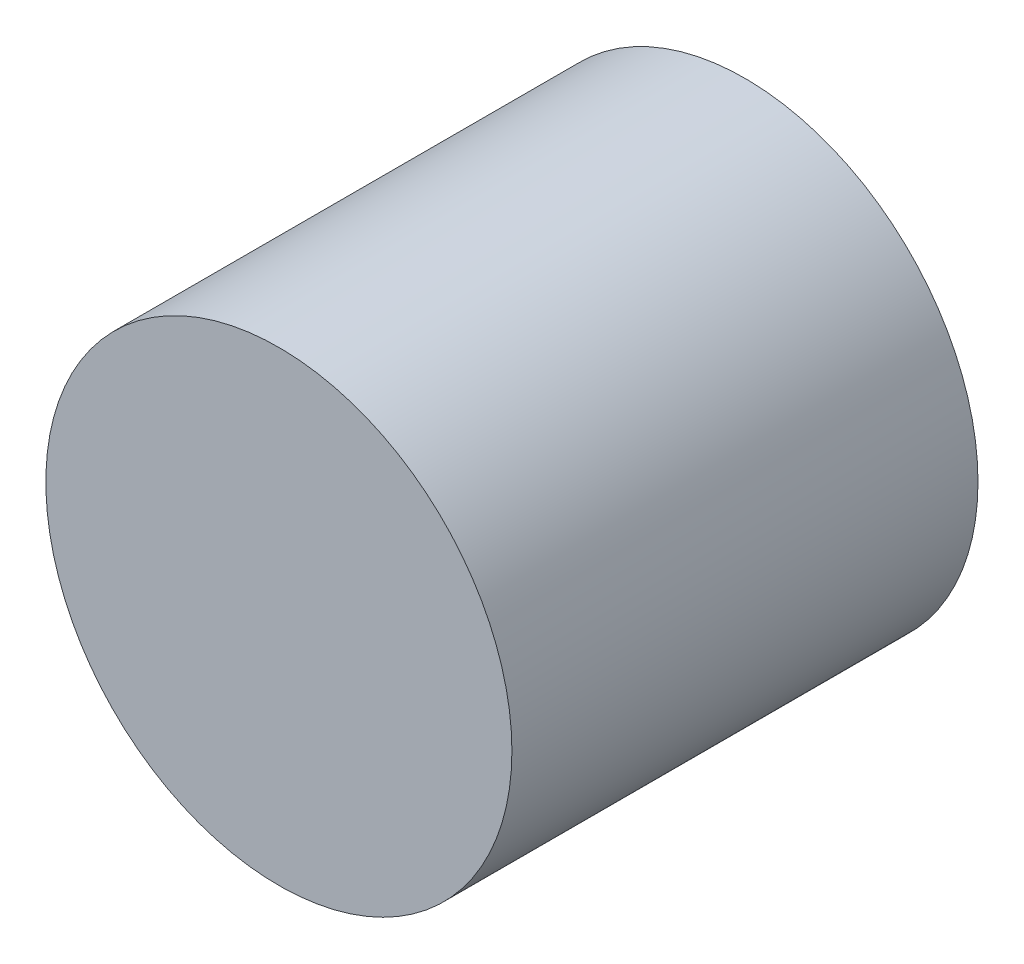
ISO-10303-21;
HEADER;
FILE_DESCRIPTION(('STEP AP214'),'2;1');
FILE_NAME('part.step','',(''),(''),'','','');
FILE_SCHEMA(('AUTOMOTIVE_DESIGN { 1 0 10303 214 1 1 1 1 }'));
ENDSEC;
DATA;
#1=APPLICATION_CONTEXT('core data for automotive mechanical design processes');
#2=APPLICATION_PROTOCOL_DEFINITION('international standard','automotive_design',2000,#1);
#3=PRODUCT_CONTEXT('',#1,'mechanical');
#4=PRODUCT('Part','Part','',(#3));
#5=PRODUCT_RELATED_PRODUCT_CATEGORY('part','',(#4));
#6=PRODUCT_DEFINITION_FORMATION('','',#4);
#7=PRODUCT_DEFINITION_CONTEXT('part definition',#1,'design');
#8=PRODUCT_DEFINITION('design','',#6,#7);
#9=PRODUCT_DEFINITION_SHAPE('','',#8);
#10=(LENGTH_UNIT() NAMED_UNIT(*) SI_UNIT(.MILLI.,.METRE.));
#11=(NAMED_UNIT(*) PLANE_ANGLE_UNIT() SI_UNIT($,.RADIAN.));
#12=(NAMED_UNIT(*) SI_UNIT($,.STERADIAN.) SOLID_ANGLE_UNIT());
#13=UNCERTAINTY_MEASURE_WITH_UNIT(LENGTH_MEASURE(1.E-05),#10,'distance_accuracy_value','');
#14=(GEOMETRIC_REPRESENTATION_CONTEXT(3) GLOBAL_UNCERTAINTY_ASSIGNED_CONTEXT((#13)) GLOBAL_UNIT_ASSIGNED_CONTEXT((#10,
#11,#12)) REPRESENTATION_CONTEXT('',''));
#15=CARTESIAN_POINT('',(0.,0.,0.));
#16=DIRECTION('',(0.,0.,1.));
#17=DIRECTION('',(1.,0.,0.));
#18=AXIS2_PLACEMENT_3D('',#15,#16,#17);
#19=CARTESIAN_POINT('',(0.,0.,0.5));
#20=DIRECTION('',(0.,0.,-1.));
#21=DIRECTION('',(-1.,0.,0.));
#22=AXIS2_PLACEMENT_3D('',#19,#20,#21);
#23=CYLINDRICAL_SURFACE('',#22,0.25);
#24=CARTESIAN_POINT('',(0.,0.,0.5));
#25=DIRECTION('',(0.,0.,1.));
#26=DIRECTION('',(1.,0.,0.));
#27=AXIS2_PLACEMENT_3D('',#24,#25,#26);
#28=CIRCLE('',#27,0.25);
#29=CARTESIAN_POINT('',(0.25,0.,0.5));
#30=VERTEX_POINT('',#29);
#31=EDGE_CURVE('E11',#30,#30,#28,.T.);
#32=ORIENTED_EDGE('',*,*,#31,.F.);
#33=EDGE_LOOP('',(#32));
#34=FACE_BOUND('',#33,.T.);
#35=CARTESIAN_POINT('',(0.,0.,0.));
#36=DIRECTION('',(0.,0.,1.));
#37=DIRECTION('',(1.,0.,0.));
#38=AXIS2_PLACEMENT_3D('',#35,#36,#37);
#39=CIRCLE('',#38,0.25);
#40=CARTESIAN_POINT('',(0.25,0.,0.));
#41=VERTEX_POINT('',#40);
#42=EDGE_CURVE('E37',#41,#41,#39,.T.);
#43=ORIENTED_EDGE('',*,*,#42,.T.);
#44=EDGE_LOOP('',(#43));
#45=FACE_BOUND('',#44,.T.);
#46=ADVANCED_FACE('F34',(#34,#45),#23,.T.);
#47=CARTESIAN_POINT('',(0.,0.,0.5));
#48=DIRECTION('',(0.,0.,1.));
#49=DIRECTION('',(1.,0.,0.));
#50=AXIS2_PLACEMENT_3D('',#47,#48,#49);
#51=PLANE('',#50);
#52=ORIENTED_EDGE('',*,*,#31,.T.);
#53=EDGE_LOOP('',(#52));
#54=FACE_BOUND('',#53,.T.);
#55=ADVANCED_FACE('F63',(#54),#51,.T.);
#56=CARTESIAN_POINT('',(0.,0.,0.));
#57=DIRECTION('',(0.,0.,1.));
#58=DIRECTION('',(1.,0.,0.));
#59=AXIS2_PLACEMENT_3D('',#56,#57,#58);
#60=PLANE('',#59);
#61=CARTESIAN_POINT('',(0.,0.,0.));
#62=DIRECTION('',(0.,0.,-1.));
#63=DIRECTION('',(-1.,0.,0.));
#64=AXIS2_PLACEMENT_3D('',#61,#62,#63);
#65=CIRCLE('',#64,0.0999999999999999);
#66=CARTESIAN_POINT('',(-0.0999999999999999,0.,0.));
#67=VERTEX_POINT('',#66);
#68=EDGE_CURVE('E53',#67,#67,#65,.T.);
#69=ORIENTED_EDGE('',*,*,#68,.F.);
#70=EDGE_LOOP('',(#69));
#71=FACE_BOUND('',#70,.T.);
#72=ORIENTED_EDGE('',*,*,#42,.F.);
#73=EDGE_LOOP('',(#72));
#74=FACE_BOUND('',#73,.T.);
#75=ADVANCED_FACE('F47',(#71,#74),#60,.F.);
#76=CARTESIAN_POINT('',(0.,0.,0.25));
#77=DIRECTION('',(0.,0.,-1.));
#78=DIRECTION('',(-1.,0.,0.));
#79=AXIS2_PLACEMENT_3D('',#76,#77,#78);
#80=CONICAL_SURFACE('',#79,0.0999999999999999,1.02974425867665);
#81=CARTESIAN_POINT('',(0.,0.,0.310086061902756));
#82=VERTEX_POINT('',#81);
#83=VERTEX_LOOP('',#82);
#84=FACE_BOUND('',#83,.T.);
#85=CARTESIAN_POINT('',(0.,0.,0.25));
#86=DIRECTION('',(0.,0.,-1.));
#87=DIRECTION('',(-1.,0.,0.));
#88=AXIS2_PLACEMENT_3D('',#85,#86,#87);
#89=CIRCLE('',#88,0.0999999999999999);
#90=CARTESIAN_POINT('',(-0.0999999999999999,0.,0.25));
#91=VERTEX_POINT('',#90);
#92=EDGE_CURVE('E51',#91,#91,#89,.T.);
#93=ORIENTED_EDGE('',*,*,#92,.T.);
#94=EDGE_LOOP('',(#93));
#95=FACE_BOUND('',#94,.T.);
#96=ADVANCED_FACE('F43',(#84,#95),#80,.F.);
#97=CARTESIAN_POINT('',(0.,0.,0.));
#98=DIRECTION('',(0.,0.,-1.));
#99=DIRECTION('',(-1.,0.,0.));
#100=AXIS2_PLACEMENT_3D('',#97,#98,#99);
#101=CYLINDRICAL_SURFACE('',#100,0.0999999999999999);
#102=ORIENTED_EDGE('',*,*,#92,.F.);
#103=EDGE_LOOP('',(#102));
#104=FACE_BOUND('',#103,.T.);
#105=ORIENTED_EDGE('',*,*,#68,.T.);
#106=EDGE_LOOP('',(#105));
#107=FACE_BOUND('',#106,.T.);
#108=ADVANCED_FACE('F46',(#104,#107),#101,.F.);
#109=CLOSED_SHELL('',(#46,#55,#75,#96,#108));
#110=MANIFOLD_SOLID_BREP('B2',#109);
#111=ADVANCED_BREP_SHAPE_REPRESENTATION('',(#18,#110),#14);
#112=SHAPE_DEFINITION_REPRESENTATION(#9,#111);
ENDSEC;
END-ISO-10303-21;
